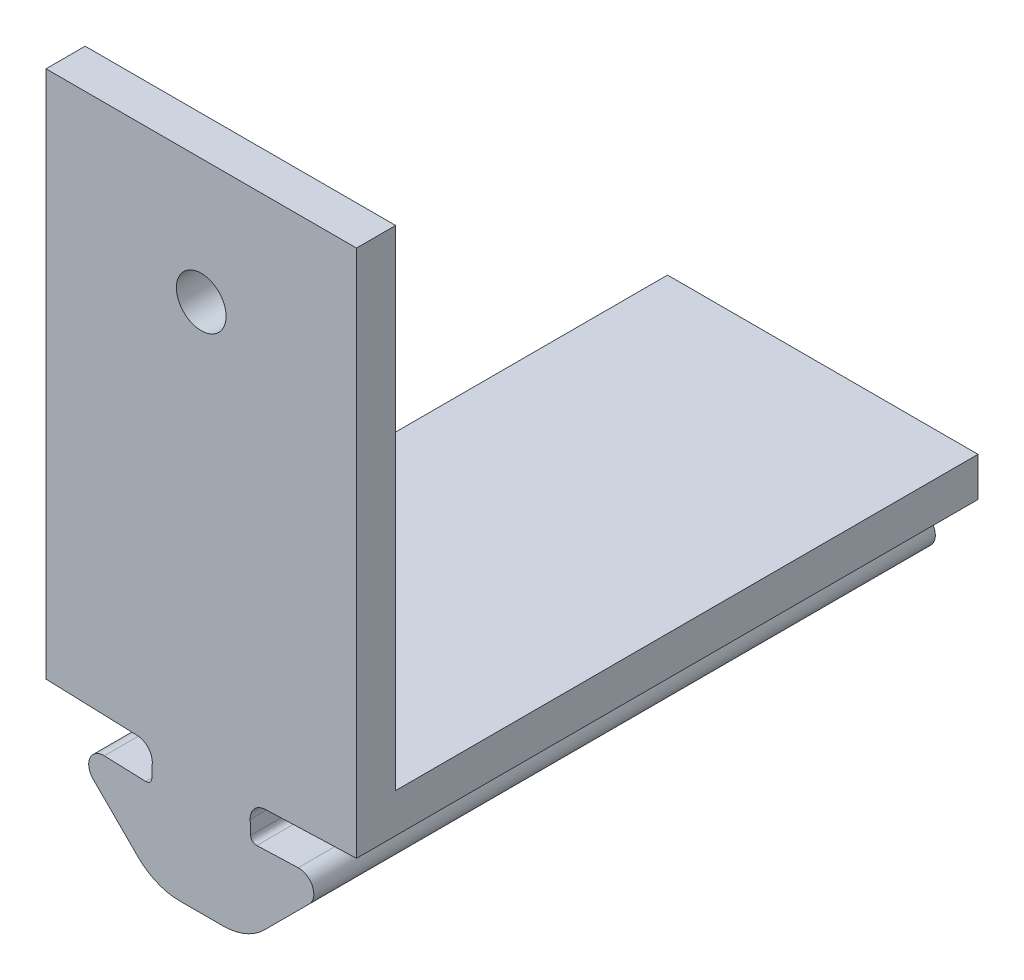
ISO-10303-21;
HEADER;
FILE_DESCRIPTION(('STEP AP214'),'2;1');
FILE_NAME('part.step','',(''),(''),'','','');
FILE_SCHEMA(('AUTOMOTIVE_DESIGN { 1 0 10303 214 1 1 1 1 }'));
ENDSEC;
DATA;
#1=APPLICATION_CONTEXT('core data for automotive mechanical design processes');
#2=APPLICATION_PROTOCOL_DEFINITION('international standard','automotive_design',2000,#1);
#3=PRODUCT_CONTEXT('',#1,'mechanical');
#4=PRODUCT('Part','Part','',(#3));
#5=PRODUCT_RELATED_PRODUCT_CATEGORY('part','',(#4));
#6=PRODUCT_DEFINITION_FORMATION('','',#4);
#7=PRODUCT_DEFINITION_CONTEXT('part definition',#1,'design');
#8=PRODUCT_DEFINITION('design','',#6,#7);
#9=PRODUCT_DEFINITION_SHAPE('','',#8);
#10=(LENGTH_UNIT() NAMED_UNIT(*) SI_UNIT(.MILLI.,.METRE.));
#11=(NAMED_UNIT(*) PLANE_ANGLE_UNIT() SI_UNIT($,.RADIAN.));
#12=(NAMED_UNIT(*) SI_UNIT($,.STERADIAN.) SOLID_ANGLE_UNIT());
#13=UNCERTAINTY_MEASURE_WITH_UNIT(LENGTH_MEASURE(1.E-05),#10,'distance_accuracy_value','');
#14=(GEOMETRIC_REPRESENTATION_CONTEXT(3) GLOBAL_UNCERTAINTY_ASSIGNED_CONTEXT((#13)) GLOBAL_UNIT_ASSIGNED_CONTEXT((#10,
#11,#12)) REPRESENTATION_CONTEXT('',''));
#15=CARTESIAN_POINT('',(0.,0.,0.));
#16=DIRECTION('',(0.,0.,1.));
#17=DIRECTION('',(1.,0.,0.));
#18=AXIS2_PLACEMENT_3D('',#15,#16,#17);
#19=CARTESIAN_POINT('',(-50.6754357820215,45.6203327442278,31.75));
#20=DIRECTION('',(0.,0.,-1.));
#21=DIRECTION('',(-1.,0.,0.));
#22=AXIS2_PLACEMENT_3D('',#19,#20,#21);
#23=CYLINDRICAL_SURFACE('',#22,0.300000000000002);
#24=CARTESIAN_POINT('',(-50.6754357820215,45.6203327442278,0.));
#25=DIRECTION('',(0.,0.,-1.));
#26=DIRECTION('',(1.,0.,0.));
#27=AXIS2_PLACEMENT_3D('',#24,#25,#26);
#28=CIRCLE('',#27,0.300000000000002);
#29=CARTESIAN_POINT('',(-50.3756185339158,45.609862895217,0.));
#30=VERTEX_POINT('',#29);
#31=CARTESIAN_POINT('',(-50.6859056310322,45.320515496122,0.));
#32=VERTEX_POINT('',#31);
#33=EDGE_CURVE('E167',#30,#32,#28,.T.);
#34=ORIENTED_EDGE('',*,*,#33,.T.);
#35=DIRECTION('',(0.,0.,-1.));
#36=VECTOR('',#35,1.);
#37=CARTESIAN_POINT('',(-50.6859056310322,45.320515496122,31.75));
#38=LINE('',#37,#36);
#39=CARTESIAN_POINT('',(-50.6859056310322,45.320515496122,31.75));
#40=VERTEX_POINT('',#39);
#41=EDGE_CURVE('E11',#40,#32,#38,.T.);
#42=ORIENTED_EDGE('',*,*,#41,.F.);
#43=CARTESIAN_POINT('',(-50.6754357820215,45.6203327442278,31.75));
#44=DIRECTION('',(0.,0.,-1.));
#45=DIRECTION('',(1.,0.,0.));
#46=AXIS2_PLACEMENT_3D('',#43,#44,#45);
#47=CIRCLE('',#46,0.300000000000002);
#48=CARTESIAN_POINT('',(-50.3756185339158,45.609862895217,31.75));
#49=VERTEX_POINT('',#48);
#50=EDGE_CURVE('E195',#49,#40,#47,.T.);
#51=ORIENTED_EDGE('',*,*,#50,.F.);
#52=DIRECTION('',(0.,0.,-1.));
#53=VECTOR('',#52,1.);
#54=CARTESIAN_POINT('',(-50.3756185339158,45.609862895217,31.75));
#55=LINE('',#54,#53);
#56=EDGE_CURVE('E163',#49,#30,#55,.T.);
#57=ORIENTED_EDGE('',*,*,#56,.T.);
#58=EDGE_LOOP('',(#34,#42,#51,#57));
#59=FACE_BOUND('',#58,.T.);
#60=ADVANCED_FACE('F47',(#59),#23,.F.);
#61=CARTESIAN_POINT('',(-50.6859056310322,45.320515496122,31.75));
#62=DIRECTION('',(-0.0348994967024436,-0.999390827019098,0.));
#63=DIRECTION('',(0.999390827019098,-0.0348994967024436,0.));
#64=AXIS2_PLACEMENT_3D('',#61,#62,#63);
#65=PLANE('',#64);
#66=DIRECTION('',(-0.999390827019098,0.0348994967024436,0.));
#67=VECTOR('',#66,1.);
#68=CARTESIAN_POINT('',(-50.6859056310322,45.320515496122,0.));
#69=LINE('',#68,#67);
#70=CARTESIAN_POINT('',(-52.803734095959,45.3944716957687,0.));
#71=VERTEX_POINT('',#70);
#72=EDGE_CURVE('E171',#32,#71,#69,.T.);
#73=ORIENTED_EDGE('',*,*,#72,.T.);
#74=DIRECTION('',(0.,0.,-1.));
#75=VECTOR('',#74,1.);
#76=CARTESIAN_POINT('',(-52.803734095959,45.3944716957687,31.75));
#77=LINE('',#76,#75);
#78=CARTESIAN_POINT('',(-52.803734095959,45.3944716957687,31.75));
#79=VERTEX_POINT('',#78);
#80=EDGE_CURVE('E55',#79,#71,#77,.T.);
#81=ORIENTED_EDGE('',*,*,#80,.F.);
#82=DIRECTION('',(-0.999390827019098,0.0348994967024436,0.));
#83=VECTOR('',#82,1.);
#84=CARTESIAN_POINT('',(-50.6859056310322,45.320515496122,31.75));
#85=LINE('',#84,#83);
#86=EDGE_CURVE('E115',#40,#79,#85,.T.);
#87=ORIENTED_EDGE('',*,*,#86,.F.);
#88=ORIENTED_EDGE('',*,*,#41,.T.);
#89=EDGE_LOOP('',(#73,#81,#87,#88));
#90=FACE_BOUND('',#89,.T.);
#91=ADVANCED_FACE('F506',(#90),#65,.F.);
#92=CARTESIAN_POINT('',(-52.8306099066512,44.6248491736012,31.75));
#93=DIRECTION('',(0.,0.,-1.));
#94=DIRECTION('',(-1.,0.,0.));
#95=AXIS2_PLACEMENT_3D('',#92,#93,#94);
#96=CYLINDRICAL_SURFACE('',#95,0.770091641188153);
#97=CARTESIAN_POINT('',(-52.8306099066512,44.6248491736012,0.));
#98=DIRECTION('',(0.,0.,1.));
#99=DIRECTION('',(1.,0.,0.));
#100=AXIS2_PLACEMENT_3D('',#97,#98,#99);
#101=CIRCLE('',#100,0.770091641188153);
#102=CARTESIAN_POINT('',(-53.3751469282704,44.0803121519819,0.));
#103=VERTEX_POINT('',#102);
#104=EDGE_CURVE('E175',#71,#103,#101,.T.);
#105=ORIENTED_EDGE('',*,*,#104,.T.);
#106=DIRECTION('',(0.,0.,-1.));
#107=VECTOR('',#106,1.);
#108=CARTESIAN_POINT('',(-53.3751469282704,44.0803121519819,31.75));
#109=LINE('',#108,#107);
#110=CARTESIAN_POINT('',(-53.3751469282704,44.0803121519819,31.75));
#111=VERTEX_POINT('',#110);
#112=EDGE_CURVE('E210',#111,#103,#109,.T.);
#113=ORIENTED_EDGE('',*,*,#112,.F.);
#114=CARTESIAN_POINT('',(-52.8306099066512,44.6248491736012,31.75));
#115=DIRECTION('',(0.,0.,1.));
#116=DIRECTION('',(1.,0.,0.));
#117=AXIS2_PLACEMENT_3D('',#114,#115,#116);
#118=CIRCLE('',#117,0.770091641188153);
#119=EDGE_CURVE('E220',#79,#111,#118,.T.);
#120=ORIENTED_EDGE('',*,*,#119,.F.);
#121=ORIENTED_EDGE('',*,*,#80,.T.);
#122=EDGE_LOOP('',(#105,#113,#120,#121));
#123=FACE_BOUND('',#122,.T.);
#124=ADVANCED_FACE('F218',(#123),#96,.T.);
#125=CARTESIAN_POINT('',(-51.0742666676735,41.7794318913851,31.75));
#126=DIRECTION('',(0.707106781186544,0.707106781186551,0.));
#127=DIRECTION('',(-0.707106781186551,0.707106781186544,0.));
#128=AXIS2_PLACEMENT_3D('',#125,#126,#127);
#129=PLANE('',#128);
#130=DIRECTION('',(0.707106781186551,-0.707106781186544,0.));
#131=VECTOR('',#130,1.);
#132=CARTESIAN_POINT('',(-51.0742666676735,41.7794318913851,0.));
#133=LINE('',#132,#131);
#134=CARTESIAN_POINT('',(-51.0742666676735,41.7794318913851,0.));
#135=VERTEX_POINT('',#134);
#136=EDGE_CURVE('E178',#103,#135,#133,.T.);
#137=ORIENTED_EDGE('',*,*,#136,.T.);
#138=DIRECTION('',(0.,0.,-1.));
#139=VECTOR('',#138,1.);
#140=CARTESIAN_POINT('',(-51.0742666676735,41.7794318913851,31.75));
#141=LINE('',#140,#139);
#142=CARTESIAN_POINT('',(-51.0742666676735,41.7794318913851,31.75));
#143=VERTEX_POINT('',#142);
#144=EDGE_CURVE('E206',#143,#135,#141,.T.);
#145=ORIENTED_EDGE('',*,*,#144,.F.);
#146=DIRECTION('',(0.707106781186551,-0.707106781186544,0.));
#147=VECTOR('',#146,1.);
#148=CARTESIAN_POINT('',(-51.0742666676735,41.7794318913851,31.75));
#149=LINE('',#148,#147);
#150=EDGE_CURVE('E239',#111,#143,#149,.T.);
#151=ORIENTED_EDGE('',*,*,#150,.F.);
#152=ORIENTED_EDGE('',*,*,#112,.T.);
#153=EDGE_LOOP('',(#137,#145,#151,#152));
#154=FACE_BOUND('',#153,.T.);
#155=ADVANCED_FACE('F229',(#154),#129,.F.);
#156=CARTESIAN_POINT('',(-48.9529463241139,43.9007522349447,31.75));
#157=DIRECTION('',(0.,0.,-1.));
#158=DIRECTION('',(-1.,0.,0.));
#159=AXIS2_PLACEMENT_3D('',#156,#157,#158);
#160=CYLINDRICAL_SURFACE('',#159,3.);
#161=CARTESIAN_POINT('',(-48.9529463241139,43.9007522349447,0.));
#162=DIRECTION('',(0.,0.,1.));
#163=DIRECTION('',(1.,0.,0.));
#164=AXIS2_PLACEMENT_3D('',#161,#162,#163);
#165=CIRCLE('',#164,3.);
#166=CARTESIAN_POINT('',(-48.9529463241139,40.9007522349447,0.));
#167=VERTEX_POINT('',#166);
#168=EDGE_CURVE('E181',#135,#167,#165,.T.);
#169=ORIENTED_EDGE('',*,*,#168,.T.);
#170=DIRECTION('',(0.,0.,-1.));
#171=VECTOR('',#170,1.);
#172=CARTESIAN_POINT('',(-48.9529463241139,40.9007522349447,31.75));
#173=LINE('',#172,#171);
#174=CARTESIAN_POINT('',(-48.9529463241139,40.9007522349447,31.75));
#175=VERTEX_POINT('',#174);
#176=EDGE_CURVE('E202',#175,#167,#173,.T.);
#177=ORIENTED_EDGE('',*,*,#176,.F.);
#178=CARTESIAN_POINT('',(-48.9529463241139,43.9007522349447,31.75));
#179=DIRECTION('',(0.,0.,1.));
#180=DIRECTION('',(1.,0.,0.));
#181=AXIS2_PLACEMENT_3D('',#178,#179,#180);
#182=CIRCLE('',#181,3.);
#183=EDGE_CURVE('E235',#143,#175,#182,.T.);
#184=ORIENTED_EDGE('',*,*,#183,.F.);
#185=ORIENTED_EDGE('',*,*,#144,.T.);
#186=EDGE_LOOP('',(#169,#177,#184,#185));
#187=FACE_BOUND('',#186,.T.);
#188=ADVANCED_FACE('F233',(#187),#160,.T.);
#189=CARTESIAN_POINT('',(-47.8507015478393,40.9007522349447,31.75));
#190=DIRECTION('',(0.,1.,0.));
#191=DIRECTION('',(0.,0.,1.));
#192=AXIS2_PLACEMENT_3D('',#189,#190,#191);
#193=PLANE('',#192);
#194=DIRECTION('',(1.,0.,0.));
#195=VECTOR('',#194,1.);
#196=CARTESIAN_POINT('',(-47.8507015478393,40.9007522349447,0.));
#197=LINE('',#196,#195);
#198=CARTESIAN_POINT('',(-46.7484567715648,40.9007522349447,0.));
#199=VERTEX_POINT('',#198);
#200=EDGE_CURVE('E184',#167,#199,#197,.T.);
#201=ORIENTED_EDGE('',*,*,#200,.T.);
#202=DIRECTION('',(0.,0.,-1.));
#203=VECTOR('',#202,1.);
#204=CARTESIAN_POINT('',(-46.7484567715648,40.9007522349447,31.75));
#205=LINE('',#204,#203);
#206=CARTESIAN_POINT('',(-46.7484567715648,40.9007522349447,31.75));
#207=VERTEX_POINT('',#206);
#208=EDGE_CURVE('E266',#207,#199,#205,.T.);
#209=ORIENTED_EDGE('',*,*,#208,.F.);
#210=DIRECTION('',(1.,0.,0.));
#211=VECTOR('',#210,1.);
#212=CARTESIAN_POINT('',(-47.8507015478393,40.9007522349447,31.75));
#213=LINE('',#212,#211);
#214=EDGE_CURVE('E146',#175,#207,#213,.T.);
#215=ORIENTED_EDGE('',*,*,#214,.F.);
#216=ORIENTED_EDGE('',*,*,#176,.T.);
#217=EDGE_LOOP('',(#201,#209,#215,#216));
#218=FACE_BOUND('',#217,.T.);
#219=ADVANCED_FACE('F528',(#218),#193,.F.);
#220=CARTESIAN_POINT('',(-55.7809025544344,47.2995338889829,31.75));
#221=DIRECTION('',(0.0348994967024436,0.999390827019098,0.));
#222=DIRECTION('',(-0.999390827019098,0.0348994967024436,0.));
#223=AXIS2_PLACEMENT_3D('',#220,#221,#222);
#224=PLANE('',#223);
#225=DIRECTION('',(0.999390827019098,-0.0348994967024436,0.));
#226=VECTOR('',#225,1.);
#227=CARTESIAN_POINT('',(-55.7809025544344,47.2995338889829,0.));
#228=LINE('',#227,#226);
#229=CARTESIAN_POINT('',(-55.7809025544344,47.2995338889829,0.));
#230=VERTEX_POINT('',#229);
#231=CARTESIAN_POINT('',(-51.1227819504774,47.1368687331076,0.));
#232=VERTEX_POINT('',#231);
#233=EDGE_CURVE('E152',#230,#232,#228,.T.);
#234=ORIENTED_EDGE('',*,*,#233,.T.);
#235=DIRECTION('',(0.,0.,-1.));
#236=VECTOR('',#235,1.);
#237=CARTESIAN_POINT('',(-51.1227819504774,47.1368687331076,31.75));
#238=LINE('',#237,#236);
#239=CARTESIAN_POINT('',(-51.1227819504774,47.1368687331076,31.75));
#240=VERTEX_POINT('',#239);
#241=EDGE_CURVE('E149',#240,#232,#238,.T.);
#242=ORIENTED_EDGE('',*,*,#241,.F.);
#243=DIRECTION('',(0.999390827019098,-0.0348994967024436,0.));
#244=VECTOR('',#243,1.);
#245=CARTESIAN_POINT('',(-55.7809025544344,47.2995338889829,31.75));
#246=LINE('',#245,#244);
#247=CARTESIAN_POINT('',(-55.7809025544344,47.2995338889829,31.75));
#248=VERTEX_POINT('',#247);
#249=EDGE_CURVE('E134',#248,#240,#246,.T.);
#250=ORIENTED_EDGE('',*,*,#249,.F.);
#251=DIRECTION('',(0.,0.,-1.));
#252=VECTOR('',#251,1.);
#253=CARTESIAN_POINT('',(-55.7809025544344,47.2995338889829,31.75));
#254=LINE('',#253,#252);
#255=EDGE_CURVE('E156',#248,#230,#254,.T.);
#256=ORIENTED_EDGE('',*,*,#255,.T.);
#257=EDGE_LOOP('',(#234,#242,#250,#256));
#258=FACE_BOUND('',#257,.T.);
#259=ADVANCED_FACE('F150',(#258),#224,.F.);
#260=CARTESIAN_POINT('',(-51.1507015478393,46.3373560714924,31.75));
#261=DIRECTION('',(0.,0.,-1.));
#262=DIRECTION('',(-1.,0.,0.));
#263=AXIS2_PLACEMENT_3D('',#260,#261,#262);
#264=CYLINDRICAL_SURFACE('',#263,0.799999999999997);
#265=CARTESIAN_POINT('',(-51.1507015478393,46.3373560714924,0.));
#266=DIRECTION('',(0.,0.,-1.));
#267=DIRECTION('',(1.,0.,0.));
#268=AXIS2_PLACEMENT_3D('',#265,#266,#267);
#269=CIRCLE('',#268,0.799999999999997);
#270=CARTESIAN_POINT('',(-50.3511888862241,46.3094364741304,0.));
#271=VERTEX_POINT('',#270);
#272=EDGE_CURVE('E190',#232,#271,#269,.T.);
#273=ORIENTED_EDGE('',*,*,#272,.T.);
#274=DIRECTION('',(0.,0.,-1.));
#275=VECTOR('',#274,1.);
#276=CARTESIAN_POINT('',(-50.3511888862241,46.3094364741304,31.75));
#277=LINE('',#276,#275);
#278=CARTESIAN_POINT('',(-50.3511888862241,46.3094364741304,31.75));
#279=VERTEX_POINT('',#278);
#280=EDGE_CURVE('E157',#279,#271,#277,.T.);
#281=ORIENTED_EDGE('',*,*,#280,.F.);
#282=CARTESIAN_POINT('',(-51.1507015478393,46.3373560714924,31.75));
#283=DIRECTION('',(0.,0.,-1.));
#284=DIRECTION('',(1.,0.,0.));
#285=AXIS2_PLACEMENT_3D('',#282,#283,#284);
#286=CIRCLE('',#285,0.799999999999997);
#287=EDGE_CURVE('E138',#240,#279,#286,.T.);
#288=ORIENTED_EDGE('',*,*,#287,.F.);
#289=ORIENTED_EDGE('',*,*,#241,.T.);
#290=EDGE_LOOP('',(#273,#281,#288,#289));
#291=FACE_BOUND('',#290,.T.);
#292=ADVANCED_FACE('F159',(#291),#264,.F.);
#293=CARTESIAN_POINT('',(-50.3756185339158,45.609862895217,31.75));
#294=DIRECTION('',(0.999390827019098,-0.034899496702436,0.));
#295=DIRECTION('',(0.034899496702436,0.999390827019098,0.));
#296=AXIS2_PLACEMENT_3D('',#293,#294,#295);
#297=PLANE('',#296);
#298=DIRECTION('',(-0.034899496702436,-0.999390827019098,0.));
#299=VECTOR('',#298,1.);
#300=CARTESIAN_POINT('',(-50.3756185339158,45.609862895217,0.));
#301=LINE('',#300,#299);
#302=EDGE_CURVE('E107',#271,#30,#301,.T.);
#303=ORIENTED_EDGE('',*,*,#302,.T.);
#304=ORIENTED_EDGE('',*,*,#56,.F.);
#305=DIRECTION('',(-0.034899496702436,-0.999390827019098,0.));
#306=VECTOR('',#305,1.);
#307=CARTESIAN_POINT('',(-50.3756185339158,45.609862895217,31.75));
#308=LINE('',#307,#306);
#309=EDGE_CURVE('E71',#279,#49,#308,.T.);
#310=ORIENTED_EDGE('',*,*,#309,.F.);
#311=ORIENTED_EDGE('',*,*,#280,.T.);
#312=EDGE_LOOP('',(#303,#304,#310,#311));
#313=FACE_BOUND('',#312,.T.);
#314=ADVANCED_FACE('F514',(#313),#297,.F.);
#315=CARTESIAN_POINT('',(-50.6754357820215,45.6203327442278,31.75));
#316=DIRECTION('',(0.,0.,1.));
#317=DIRECTION('',(1.,0.,0.));
#318=AXIS2_PLACEMENT_3D('',#315,#316,#317);
#319=PLANE('',#318);
#320=CARTESIAN_POINT('',(-47.8507015478393,67.9495338889829,31.75));
#321=DIRECTION('',(0.,0.,1.));
#322=DIRECTION('',(1.,0.,0.));
#323=AXIS2_PLACEMENT_3D('',#320,#321,#322);
#324=CIRCLE('',#323,1.27);
#325=CARTESIAN_POINT('',(-46.5807015478393,67.9495338889829,31.75));
#326=VERTEX_POINT('',#325);
#327=EDGE_CURVE('E386',#326,#326,#324,.T.);
#328=ORIENTED_EDGE('',*,*,#327,.F.);
#329=EDGE_LOOP('',(#328));
#330=FACE_BOUND('',#329,.T.);
#331=ORIENTED_EDGE('',*,*,#50,.T.);
#332=ORIENTED_EDGE('',*,*,#86,.T.);
#333=ORIENTED_EDGE('',*,*,#119,.T.);
#334=ORIENTED_EDGE('',*,*,#150,.T.);
#335=ORIENTED_EDGE('',*,*,#183,.T.);
#336=ORIENTED_EDGE('',*,*,#214,.T.);
#337=CARTESIAN_POINT('',(-46.7484567715648,43.9007522349447,31.75));
#338=DIRECTION('',(0.,0.,-1.));
#339=DIRECTION('',(-1.,0.,0.));
#340=AXIS2_PLACEMENT_3D('',#337,#338,#339);
#341=CIRCLE('',#340,3.);
#342=CARTESIAN_POINT('',(-44.6271364280052,41.7794318913851,31.75));
#343=VERTEX_POINT('',#342);
#344=EDGE_CURVE('E331',#343,#207,#341,.T.);
#345=ORIENTED_EDGE('',*,*,#344,.F.);
#346=DIRECTION('',(-0.707106781186551,-0.707106781186544,0.));
#347=VECTOR('',#346,1.);
#348=CARTESIAN_POINT('',(-44.6271364280052,41.7794318913851,31.75));
#349=LINE('',#348,#347);
#350=CARTESIAN_POINT('',(-42.3262561674083,44.0803121519819,31.75));
#351=VERTEX_POINT('',#350);
#352=EDGE_CURVE('E327',#351,#343,#349,.T.);
#353=ORIENTED_EDGE('',*,*,#352,.F.);
#354=CARTESIAN_POINT('',(-42.8707931890275,44.6248491736012,31.75));
#355=DIRECTION('',(0.,0.,-1.));
#356=DIRECTION('',(-1.,0.,0.));
#357=AXIS2_PLACEMENT_3D('',#354,#355,#356);
#358=CIRCLE('',#357,0.770091641188153);
#359=CARTESIAN_POINT('',(-42.8976689997197,45.3944716957687,31.75));
#360=VERTEX_POINT('',#359);
#361=EDGE_CURVE('E323',#360,#351,#358,.T.);
#362=ORIENTED_EDGE('',*,*,#361,.F.);
#363=DIRECTION('',(0.999390827019098,0.0348994967024436,0.));
#364=VECTOR('',#363,1.);
#365=CARTESIAN_POINT('',(-45.0154974646464,45.320515496122,31.75));
#366=LINE('',#365,#364);
#367=CARTESIAN_POINT('',(-45.0154974646464,45.320515496122,31.75));
#368=VERTEX_POINT('',#367);
#369=EDGE_CURVE('E286',#368,#360,#366,.T.);
#370=ORIENTED_EDGE('',*,*,#369,.F.);
#371=CARTESIAN_POINT('',(-45.0259673136572,45.6203327442278,31.75));
#372=DIRECTION('',(0.,0.,1.));
#373=DIRECTION('',(-1.,0.,0.));
#374=AXIS2_PLACEMENT_3D('',#371,#372,#373);
#375=CIRCLE('',#374,0.300000000000002);
#376=CARTESIAN_POINT('',(-45.3257845617629,45.609862895217,31.75));
#377=VERTEX_POINT('',#376);
#378=EDGE_CURVE('E291',#377,#368,#375,.T.);
#379=ORIENTED_EDGE('',*,*,#378,.F.);
#380=DIRECTION('',(0.034899496702436,-0.999390827019098,0.));
#381=VECTOR('',#380,1.);
#382=CARTESIAN_POINT('',(-45.3257845617629,45.609862895217,31.75));
#383=LINE('',#382,#381);
#384=CARTESIAN_POINT('',(-45.3502142094546,46.3094364741304,31.75));
#385=VERTEX_POINT('',#384);
#386=EDGE_CURVE('E343',#385,#377,#383,.T.);
#387=ORIENTED_EDGE('',*,*,#386,.F.);
#388=CARTESIAN_POINT('',(-44.5507015478393,46.3373560714924,31.75));
#389=DIRECTION('',(0.,0.,1.));
#390=DIRECTION('',(-1.,0.,0.));
#391=AXIS2_PLACEMENT_3D('',#388,#389,#390);
#392=CIRCLE('',#391,0.799999999999997);
#393=CARTESIAN_POINT('',(-44.5786211452013,47.1368687331076,31.75));
#394=VERTEX_POINT('',#393);
#395=EDGE_CURVE('E339',#394,#385,#392,.T.);
#396=ORIENTED_EDGE('',*,*,#395,.F.);
#397=DIRECTION('',(-0.999390827019098,-0.0348994967024436,0.));
#398=VECTOR('',#397,1.);
#399=CARTESIAN_POINT('',(-39.9205005412442,47.2995338889829,31.75));
#400=LINE('',#399,#398);
#401=CARTESIAN_POINT('',(-39.9205005412442,47.2995338889829,31.75));
#402=VERTEX_POINT('',#401);
#403=EDGE_CURVE('E335',#402,#394,#400,.T.);
#404=ORIENTED_EDGE('',*,*,#403,.F.);
#405=DIRECTION('',(0.,-1.,0.));
#406=VECTOR('',#405,1.);
#407=CARTESIAN_POINT('',(-39.9205005412442,49.2995338889829,31.75));
#408=LINE('',#407,#406);
#409=CARTESIAN_POINT('',(-39.9205005412442,74.2995338889829,31.75));
#410=VERTEX_POINT('',#409);
#411=EDGE_CURVE('E352',#410,#402,#408,.T.);
#412=ORIENTED_EDGE('',*,*,#411,.F.);
#413=DIRECTION('',(1.,0.,0.));
#414=VECTOR('',#413,1.);
#415=CARTESIAN_POINT('',(-55.7809025544344,74.2995338889829,31.75));
#416=LINE('',#415,#414);
#417=CARTESIAN_POINT('',(-55.7809025544344,74.2995338889829,31.75));
#418=VERTEX_POINT('',#417);
#419=EDGE_CURVE('E394',#418,#410,#416,.T.);
#420=ORIENTED_EDGE('',*,*,#419,.F.);
#421=DIRECTION('',(0.,-1.,0.));
#422=VECTOR('',#421,1.);
#423=CARTESIAN_POINT('',(-55.7809025544344,49.2995338889829,31.75));
#424=LINE('',#423,#422);
#425=EDGE_CURVE('E142',#418,#248,#424,.T.);
#426=ORIENTED_EDGE('',*,*,#425,.T.);
#427=ORIENTED_EDGE('',*,*,#249,.T.);
#428=ORIENTED_EDGE('',*,*,#287,.T.);
#429=ORIENTED_EDGE('',*,*,#309,.T.);
#430=EDGE_LOOP('',(#331,#332,#333,#334,#335,#336,#345,#353,#362,#370,#379,#387,#396,#404,#412,
#420,#426,#427,#428,#429));
#431=FACE_BOUND('',#430,.T.);
#432=ADVANCED_FACE('F136',(#330,#431),#319,.T.);
#433=CARTESIAN_POINT('',(-50.6754357820215,45.6203327442278,0.));
#434=DIRECTION('',(0.,0.,1.));
#435=DIRECTION('',(1.,0.,0.));
#436=AXIS2_PLACEMENT_3D('',#433,#434,#435);
#437=PLANE('',#436);
#438=ORIENTED_EDGE('',*,*,#33,.F.);
#439=ORIENTED_EDGE('',*,*,#302,.F.);
#440=ORIENTED_EDGE('',*,*,#272,.F.);
#441=ORIENTED_EDGE('',*,*,#233,.F.);
#442=DIRECTION('',(0.,-1.,0.));
#443=VECTOR('',#442,1.);
#444=CARTESIAN_POINT('',(-55.7809025544344,49.2995338889829,0.));
#445=LINE('',#444,#443);
#446=CARTESIAN_POINT('',(-55.7809025544344,49.2995338889829,0.));
#447=VERTEX_POINT('',#446);
#448=EDGE_CURVE('E360',#447,#230,#445,.T.);
#449=ORIENTED_EDGE('',*,*,#448,.F.);
#450=DIRECTION('',(-1.,0.,0.));
#451=VECTOR('',#450,1.);
#452=CARTESIAN_POINT('',(-55.7809025544344,49.2995338889829,0.));
#453=LINE('',#452,#451);
#454=CARTESIAN_POINT('',(-39.9205005412442,49.2995338889829,0.));
#455=VERTEX_POINT('',#454);
#456=EDGE_CURVE('E364',#455,#447,#453,.T.);
#457=ORIENTED_EDGE('',*,*,#456,.F.);
#458=DIRECTION('',(0.,-1.,0.));
#459=VECTOR('',#458,1.);
#460=CARTESIAN_POINT('',(-39.9205005412442,49.2995338889829,0.));
#461=LINE('',#460,#459);
#462=CARTESIAN_POINT('',(-39.9205005412442,47.2995338889829,0.));
#463=VERTEX_POINT('',#462);
#464=EDGE_CURVE('E356',#455,#463,#461,.T.);
#465=ORIENTED_EDGE('',*,*,#464,.T.);
#466=DIRECTION('',(-0.999390827019098,-0.0348994967024436,0.));
#467=VECTOR('',#466,1.);
#468=CARTESIAN_POINT('',(-39.9205005412442,47.2995338889829,0.));
#469=LINE('',#468,#467);
#470=CARTESIAN_POINT('',(-44.5786211452013,47.1368687331076,0.));
#471=VERTEX_POINT('',#470);
#472=EDGE_CURVE('E304',#463,#471,#469,.T.);
#473=ORIENTED_EDGE('',*,*,#472,.T.);
#474=CARTESIAN_POINT('',(-44.5507015478393,46.3373560714924,0.));
#475=DIRECTION('',(0.,0.,1.));
#476=DIRECTION('',(-1.,0.,0.));
#477=AXIS2_PLACEMENT_3D('',#474,#475,#476);
#478=CIRCLE('',#477,0.799999999999997);
#479=CARTESIAN_POINT('',(-45.3502142094546,46.3094364741304,0.));
#480=VERTEX_POINT('',#479);
#481=EDGE_CURVE('E308',#471,#480,#478,.T.);
#482=ORIENTED_EDGE('',*,*,#481,.T.);
#483=DIRECTION('',(0.034899496702436,-0.999390827019098,0.));
#484=VECTOR('',#483,1.);
#485=CARTESIAN_POINT('',(-45.3257845617629,45.609862895217,0.));
#486=LINE('',#485,#484);
#487=CARTESIAN_POINT('',(-45.3257845617629,45.609862895217,0.));
#488=VERTEX_POINT('',#487);
#489=EDGE_CURVE('E312',#480,#488,#486,.T.);
#490=ORIENTED_EDGE('',*,*,#489,.T.);
#491=CARTESIAN_POINT('',(-45.0259673136572,45.6203327442278,0.));
#492=DIRECTION('',(0.,0.,1.));
#493=DIRECTION('',(-1.,0.,0.));
#494=AXIS2_PLACEMENT_3D('',#491,#492,#493);
#495=CIRCLE('',#494,0.300000000000002);
#496=CARTESIAN_POINT('',(-45.0154974646464,45.320515496122,0.));
#497=VERTEX_POINT('',#496);
#498=EDGE_CURVE('E316',#488,#497,#495,.T.);
#499=ORIENTED_EDGE('',*,*,#498,.T.);
#500=DIRECTION('',(0.999390827019098,0.0348994967024436,0.));
#501=VECTOR('',#500,1.);
#502=CARTESIAN_POINT('',(-45.0154974646464,45.320515496122,0.));
#503=LINE('',#502,#501);
#504=CARTESIAN_POINT('',(-42.8976689997197,45.3944716957687,0.));
#505=VERTEX_POINT('',#504);
#506=EDGE_CURVE('E287',#497,#505,#503,.T.);
#507=ORIENTED_EDGE('',*,*,#506,.T.);
#508=CARTESIAN_POINT('',(-42.8707931890275,44.6248491736012,0.));
#509=DIRECTION('',(0.,0.,-1.));
#510=DIRECTION('',(-1.,0.,0.));
#511=AXIS2_PLACEMENT_3D('',#508,#509,#510);
#512=CIRCLE('',#511,0.770091641188153);
#513=CARTESIAN_POINT('',(-42.3262561674083,44.0803121519819,0.));
#514=VERTEX_POINT('',#513);
#515=EDGE_CURVE('E292',#505,#514,#512,.T.);
#516=ORIENTED_EDGE('',*,*,#515,.T.);
#517=DIRECTION('',(-0.707106781186551,-0.707106781186544,0.));
#518=VECTOR('',#517,1.);
#519=CARTESIAN_POINT('',(-44.6271364280052,41.7794318913851,0.));
#520=LINE('',#519,#518);
#521=CARTESIAN_POINT('',(-44.6271364280052,41.7794318913851,0.));
#522=VERTEX_POINT('',#521);
#523=EDGE_CURVE('E296',#514,#522,#520,.T.);
#524=ORIENTED_EDGE('',*,*,#523,.T.);
#525=CARTESIAN_POINT('',(-46.7484567715648,43.9007522349447,0.));
#526=DIRECTION('',(0.,0.,-1.));
#527=DIRECTION('',(-1.,0.,0.));
#528=AXIS2_PLACEMENT_3D('',#525,#526,#527);
#529=CIRCLE('',#528,3.);
#530=EDGE_CURVE('E300',#522,#199,#529,.T.);
#531=ORIENTED_EDGE('',*,*,#530,.T.);
#532=ORIENTED_EDGE('',*,*,#200,.F.);
#533=ORIENTED_EDGE('',*,*,#168,.F.);
#534=ORIENTED_EDGE('',*,*,#136,.F.);
#535=ORIENTED_EDGE('',*,*,#104,.F.);
#536=ORIENTED_EDGE('',*,*,#72,.F.);
#537=EDGE_LOOP('',(#438,#439,#440,#441,#449,#457,#465,#473,#482,#490,#499,#507,#516,#524,#531,
#532,#533,#534,#535,#536));
#538=FACE_BOUND('',#537,.T.);
#539=ADVANCED_FACE('F224',(#538),#437,.F.);
#540=CARTESIAN_POINT('',(-45.0259673136572,45.6203327442278,31.75));
#541=DIRECTION('',(0.,0.,-1.));
#542=DIRECTION('',(-1.,0.,0.));
#543=AXIS2_PLACEMENT_3D('',#540,#541,#542);
#544=CYLINDRICAL_SURFACE('',#543,0.300000000000002);
#545=ORIENTED_EDGE('',*,*,#498,.F.);
#546=DIRECTION('',(0.,0.,-1.));
#547=VECTOR('',#546,1.);
#548=CARTESIAN_POINT('',(-45.3257845617629,45.609862895217,31.75));
#549=LINE('',#548,#547);
#550=EDGE_CURVE('E172',#377,#488,#549,.T.);
#551=ORIENTED_EDGE('',*,*,#550,.F.);
#552=ORIENTED_EDGE('',*,*,#378,.T.);
#553=DIRECTION('',(0.,0.,-1.));
#554=VECTOR('',#553,1.);
#555=CARTESIAN_POINT('',(-45.0154974646464,45.320515496122,31.75));
#556=LINE('',#555,#554);
#557=EDGE_CURVE('E282',#368,#497,#556,.T.);
#558=ORIENTED_EDGE('',*,*,#557,.T.);
#559=EDGE_LOOP('',(#545,#551,#552,#558));
#560=FACE_BOUND('',#559,.T.);
#561=ADVANCED_FACE('F487',(#560),#544,.F.);
#562=CARTESIAN_POINT('',(-45.3257845617629,45.609862895217,31.75));
#563=DIRECTION('',(0.999390827019098,0.034899496702436,0.));
#564=DIRECTION('',(-0.034899496702436,0.999390827019098,0.));
#565=AXIS2_PLACEMENT_3D('',#562,#563,#564);
#566=PLANE('',#565);
#567=ORIENTED_EDGE('',*,*,#489,.F.);
#568=DIRECTION('',(0.,0.,-1.));
#569=VECTOR('',#568,1.);
#570=CARTESIAN_POINT('',(-45.3502142094546,46.3094364741304,31.75));
#571=LINE('',#570,#569);
#572=EDGE_CURVE('E254',#385,#480,#571,.T.);
#573=ORIENTED_EDGE('',*,*,#572,.F.);
#574=ORIENTED_EDGE('',*,*,#386,.T.);
#575=ORIENTED_EDGE('',*,*,#550,.T.);
#576=EDGE_LOOP('',(#567,#573,#574,#575));
#577=FACE_BOUND('',#576,.T.);
#578=ADVANCED_FACE('F599',(#577),#566,.T.);
#579=CARTESIAN_POINT('',(-44.5507015478393,46.3373560714924,31.75));
#580=DIRECTION('',(0.,0.,-1.));
#581=DIRECTION('',(-1.,0.,0.));
#582=AXIS2_PLACEMENT_3D('',#579,#580,#581);
#583=CYLINDRICAL_SURFACE('',#582,0.799999999999997);
#584=ORIENTED_EDGE('',*,*,#481,.F.);
#585=DIRECTION('',(0.,0.,-1.));
#586=VECTOR('',#585,1.);
#587=CARTESIAN_POINT('',(-44.5786211452013,47.1368687331076,31.75));
#588=LINE('',#587,#586);
#589=EDGE_CURVE('E258',#394,#471,#588,.T.);
#590=ORIENTED_EDGE('',*,*,#589,.F.);
#591=ORIENTED_EDGE('',*,*,#395,.T.);
#592=ORIENTED_EDGE('',*,*,#572,.T.);
#593=EDGE_LOOP('',(#584,#590,#591,#592));
#594=FACE_BOUND('',#593,.T.);
#595=ADVANCED_FACE('F606',(#594),#583,.F.);
#596=CARTESIAN_POINT('',(-39.9205005412442,47.2995338889829,31.75));
#597=DIRECTION('',(0.0348994967024436,-0.999390827019098,0.));
#598=DIRECTION('',(0.999390827019098,0.0348994967024436,0.));
#599=AXIS2_PLACEMENT_3D('',#596,#597,#598);
#600=PLANE('',#599);
#601=ORIENTED_EDGE('',*,*,#472,.F.);
#602=DIRECTION('',(0.,0.,-1.));
#603=VECTOR('',#602,1.);
#604=CARTESIAN_POINT('',(-39.9205005412442,47.2995338889829,31.75));
#605=LINE('',#604,#603);
#606=EDGE_CURVE('E262',#402,#463,#605,.T.);
#607=ORIENTED_EDGE('',*,*,#606,.F.);
#608=ORIENTED_EDGE('',*,*,#403,.T.);
#609=ORIENTED_EDGE('',*,*,#589,.T.);
#610=EDGE_LOOP('',(#601,#607,#608,#609));
#611=FACE_BOUND('',#610,.T.);
#612=ADVANCED_FACE('F615',(#611),#600,.T.);
#613=CARTESIAN_POINT('',(-46.7484567715648,43.9007522349447,31.75));
#614=DIRECTION('',(0.,0.,-1.));
#615=DIRECTION('',(-1.,0.,0.));
#616=AXIS2_PLACEMENT_3D('',#613,#614,#615);
#617=CYLINDRICAL_SURFACE('',#616,3.);
#618=ORIENTED_EDGE('',*,*,#530,.F.);
#619=DIRECTION('',(0.,0.,-1.));
#620=VECTOR('',#619,1.);
#621=CARTESIAN_POINT('',(-44.6271364280052,41.7794318913851,31.75));
#622=LINE('',#621,#620);
#623=EDGE_CURVE('E270',#343,#522,#622,.T.);
#624=ORIENTED_EDGE('',*,*,#623,.F.);
#625=ORIENTED_EDGE('',*,*,#344,.T.);
#626=ORIENTED_EDGE('',*,*,#208,.T.);
#627=EDGE_LOOP('',(#618,#624,#625,#626));
#628=FACE_BOUND('',#627,.T.);
#629=ADVANCED_FACE('F622',(#628),#617,.T.);
#630=CARTESIAN_POINT('',(-44.6271364280052,41.7794318913851,31.75));
#631=DIRECTION('',(0.707106781186544,-0.707106781186551,0.));
#632=DIRECTION('',(0.707106781186551,0.707106781186544,0.));
#633=AXIS2_PLACEMENT_3D('',#630,#631,#632);
#634=PLANE('',#633);
#635=ORIENTED_EDGE('',*,*,#523,.F.);
#636=DIRECTION('',(0.,0.,-1.));
#637=VECTOR('',#636,1.);
#638=CARTESIAN_POINT('',(-42.3262561674083,44.0803121519819,31.75));
#639=LINE('',#638,#637);
#640=EDGE_CURVE('E274',#351,#514,#639,.T.);
#641=ORIENTED_EDGE('',*,*,#640,.F.);
#642=ORIENTED_EDGE('',*,*,#352,.T.);
#643=ORIENTED_EDGE('',*,*,#623,.T.);
#644=EDGE_LOOP('',(#635,#641,#642,#643));
#645=FACE_BOUND('',#644,.T.);
#646=ADVANCED_FACE('F502',(#645),#634,.T.);
#647=CARTESIAN_POINT('',(-42.8707931890275,44.6248491736012,31.75));
#648=DIRECTION('',(0.,0.,-1.));
#649=DIRECTION('',(-1.,0.,0.));
#650=AXIS2_PLACEMENT_3D('',#647,#648,#649);
#651=CYLINDRICAL_SURFACE('',#650,0.770091641188153);
#652=ORIENTED_EDGE('',*,*,#515,.F.);
#653=DIRECTION('',(0.,0.,-1.));
#654=VECTOR('',#653,1.);
#655=CARTESIAN_POINT('',(-42.8976689997197,45.3944716957687,31.75));
#656=LINE('',#655,#654);
#657=EDGE_CURVE('E278',#360,#505,#656,.T.);
#658=ORIENTED_EDGE('',*,*,#657,.F.);
#659=ORIENTED_EDGE('',*,*,#361,.T.);
#660=ORIENTED_EDGE('',*,*,#640,.T.);
#661=EDGE_LOOP('',(#652,#658,#659,#660));
#662=FACE_BOUND('',#661,.T.);
#663=ADVANCED_FACE('F493',(#662),#651,.T.);
#664=CARTESIAN_POINT('',(-45.0154974646464,45.320515496122,31.75));
#665=DIRECTION('',(-0.0348994967024436,0.999390827019098,0.));
#666=DIRECTION('',(-0.999390827019098,-0.0348994967024436,0.));
#667=AXIS2_PLACEMENT_3D('',#664,#665,#666);
#668=PLANE('',#667);
#669=ORIENTED_EDGE('',*,*,#506,.F.);
#670=ORIENTED_EDGE('',*,*,#557,.F.);
#671=ORIENTED_EDGE('',*,*,#369,.T.);
#672=ORIENTED_EDGE('',*,*,#657,.T.);
#673=EDGE_LOOP('',(#669,#670,#671,#672));
#674=FACE_BOUND('',#673,.T.);
#675=ADVANCED_FACE('F491',(#674),#668,.T.);
#676=CARTESIAN_POINT('',(-55.7809025544344,49.2995338889829,0.));
#677=DIRECTION('',(1.,0.,0.));
#678=DIRECTION('',(0.,0.,-1.));
#679=AXIS2_PLACEMENT_3D('',#676,#677,#678);
#680=PLANE('',#679);
#681=ORIENTED_EDGE('',*,*,#255,.F.);
#682=ORIENTED_EDGE('',*,*,#425,.F.);
#683=DIRECTION('',(0.,0.,1.));
#684=VECTOR('',#683,1.);
#685=CARTESIAN_POINT('',(-55.7809025544344,74.2995338889829,29.75));
#686=LINE('',#685,#684);
#687=CARTESIAN_POINT('',(-55.7809025544344,74.2995338889829,29.75));
#688=VERTEX_POINT('',#687);
#689=EDGE_CURVE('E385',#688,#418,#686,.T.);
#690=ORIENTED_EDGE('',*,*,#689,.F.);
#691=DIRECTION('',(0.,-1.,0.));
#692=VECTOR('',#691,1.);
#693=CARTESIAN_POINT('',(-55.7809025544344,74.2995338889829,29.75));
#694=LINE('',#693,#692);
#695=CARTESIAN_POINT('',(-55.7809025544344,49.2995338889829,29.75));
#696=VERTEX_POINT('',#695);
#697=EDGE_CURVE('E378',#688,#696,#694,.T.);
#698=ORIENTED_EDGE('',*,*,#697,.T.);
#699=DIRECTION('',(0.,0.,1.));
#700=VECTOR('',#699,1.);
#701=CARTESIAN_POINT('',(-55.7809025544344,49.2995338889829,0.));
#702=LINE('',#701,#700);
#703=EDGE_CURVE('E371',#447,#696,#702,.T.);
#704=ORIENTED_EDGE('',*,*,#703,.F.);
#705=ORIENTED_EDGE('',*,*,#448,.T.);
#706=EDGE_LOOP('',(#681,#682,#690,#698,#704,#705));
#707=FACE_BOUND('',#706,.T.);
#708=ADVANCED_FACE('F427',(#707),#680,.F.);
#709=CARTESIAN_POINT('',(-39.9205005412442,49.2995338889829,0.));
#710=DIRECTION('',(-1.,0.,0.));
#711=DIRECTION('',(0.,0.,1.));
#712=AXIS2_PLACEMENT_3D('',#709,#710,#711);
#713=PLANE('',#712);
#714=ORIENTED_EDGE('',*,*,#606,.T.);
#715=ORIENTED_EDGE('',*,*,#464,.F.);
#716=DIRECTION('',(0.,0.,-1.));
#717=VECTOR('',#716,1.);
#718=CARTESIAN_POINT('',(-39.9205005412442,49.2995338889829,0.));
#719=LINE('',#718,#717);
#720=CARTESIAN_POINT('',(-39.9205005412442,49.2995338889829,29.75));
#721=VERTEX_POINT('',#720);
#722=EDGE_CURVE('E368',#721,#455,#719,.T.);
#723=ORIENTED_EDGE('',*,*,#722,.F.);
#724=DIRECTION('',(0.,-1.,0.));
#725=VECTOR('',#724,1.);
#726=CARTESIAN_POINT('',(-39.9205005412442,74.2995338889829,29.75));
#727=LINE('',#726,#725);
#728=CARTESIAN_POINT('',(-39.9205005412442,74.2995338889829,29.75));
#729=VERTEX_POINT('',#728);
#730=EDGE_CURVE('E374',#729,#721,#727,.T.);
#731=ORIENTED_EDGE('',*,*,#730,.F.);
#732=DIRECTION('',(0.,0.,-1.));
#733=VECTOR('',#732,1.);
#734=CARTESIAN_POINT('',(-39.9205005412442,74.2995338889829,29.75));
#735=LINE('',#734,#733);
#736=EDGE_CURVE('E390',#410,#729,#735,.T.);
#737=ORIENTED_EDGE('',*,*,#736,.F.);
#738=ORIENTED_EDGE('',*,*,#411,.T.);
#739=EDGE_LOOP('',(#714,#715,#723,#731,#737,#738));
#740=FACE_BOUND('',#739,.T.);
#741=ADVANCED_FACE('F500',(#740),#713,.F.);
#742=CARTESIAN_POINT('',(0.,49.2995338889829,0.));
#743=DIRECTION('',(0.,1.,0.));
#744=DIRECTION('',(0.,0.,1.));
#745=AXIS2_PLACEMENT_3D('',#742,#743,#744);
#746=PLANE('',#745);
#747=DIRECTION('',(-1.,0.,0.));
#748=VECTOR('',#747,1.);
#749=CARTESIAN_POINT('',(-55.7809025544344,49.2995338889829,29.75));
#750=LINE('',#749,#748);
#751=EDGE_CURVE('E62',#721,#696,#750,.T.);
#752=ORIENTED_EDGE('',*,*,#751,.F.);
#753=ORIENTED_EDGE('',*,*,#722,.T.);
#754=ORIENTED_EDGE('',*,*,#456,.T.);
#755=ORIENTED_EDGE('',*,*,#703,.T.);
#756=EDGE_LOOP('',(#752,#753,#754,#755));
#757=FACE_BOUND('',#756,.T.);
#758=ADVANCED_FACE('F415',(#757),#746,.T.);
#759=CARTESIAN_POINT('',(-55.7809025544344,74.2995338889829,29.75));
#760=DIRECTION('',(0.,0.,1.));
#761=DIRECTION('',(1.,0.,0.));
#762=AXIS2_PLACEMENT_3D('',#759,#760,#761);
#763=PLANE('',#762);
#764=CARTESIAN_POINT('',(-47.8507015478393,67.9495338889829,29.75));
#765=DIRECTION('',(0.,0.,-1.));
#766=DIRECTION('',(-1.,0.,0.));
#767=AXIS2_PLACEMENT_3D('',#764,#765,#766);
#768=CIRCLE('',#767,1.27);
#769=CARTESIAN_POINT('',(-49.1207015478393,67.9495338889829,29.75));
#770=VERTEX_POINT('',#769);
#771=EDGE_CURVE('E404',#770,#770,#768,.T.);
#772=ORIENTED_EDGE('',*,*,#771,.F.);
#773=EDGE_LOOP('',(#772));
#774=FACE_BOUND('',#773,.T.);
#775=ORIENTED_EDGE('',*,*,#751,.T.);
#776=ORIENTED_EDGE('',*,*,#697,.F.);
#777=DIRECTION('',(-1.,0.,0.));
#778=VECTOR('',#777,1.);
#779=CARTESIAN_POINT('',(-55.7809025544344,74.2995338889829,29.75));
#780=LINE('',#779,#778);
#781=EDGE_CURVE('E382',#729,#688,#780,.T.);
#782=ORIENTED_EDGE('',*,*,#781,.F.);
#783=ORIENTED_EDGE('',*,*,#730,.T.);
#784=EDGE_LOOP('',(#775,#776,#782,#783));
#785=FACE_BOUND('',#784,.T.);
#786=ADVANCED_FACE('F411',(#774,#785),#763,.F.);
#787=CARTESIAN_POINT('',(0.,74.2995338889829,0.));
#788=DIRECTION('',(0.,1.,0.));
#789=DIRECTION('',(0.,0.,1.));
#790=AXIS2_PLACEMENT_3D('',#787,#788,#789);
#791=PLANE('',#790);
#792=ORIENTED_EDGE('',*,*,#689,.T.);
#793=ORIENTED_EDGE('',*,*,#419,.T.);
#794=ORIENTED_EDGE('',*,*,#736,.T.);
#795=ORIENTED_EDGE('',*,*,#781,.T.);
#796=EDGE_LOOP('',(#792,#793,#794,#795));
#797=FACE_BOUND('',#796,.T.);
#798=ADVANCED_FACE('F414',(#797),#791,.T.);
#799=CARTESIAN_POINT('',(-47.8507015478393,67.9495338889829,32.29));
#800=DIRECTION('',(0.,0.,-1.));
#801=DIRECTION('',(-1.,0.,0.));
#802=AXIS2_PLACEMENT_3D('',#799,#800,#801);
#803=CYLINDRICAL_SURFACE('',#802,1.27);
#804=ORIENTED_EDGE('',*,*,#327,.T.);
#805=EDGE_LOOP('',(#804));
#806=FACE_BOUND('',#805,.T.);
#807=ORIENTED_EDGE('',*,*,#771,.T.);
#808=EDGE_LOOP('',(#807));
#809=FACE_BOUND('',#808,.T.);
#810=ADVANCED_FACE('F409',(#806,#809),#803,.F.);
#811=CLOSED_SHELL('',(#60,#91,#124,#155,#188,#219,#259,#292,#314,#432,#539,#561,#578,#595,#612,
#629,#646,#663,#675,#708,#741,#758,#786,#798,#810));
#812=MANIFOLD_SOLID_BREP('B2',#811);
#813=ADVANCED_BREP_SHAPE_REPRESENTATION('',(#18,#812),#14);
#814=SHAPE_DEFINITION_REPRESENTATION(#9,#813);
ENDSEC;
END-ISO-10303-21;
